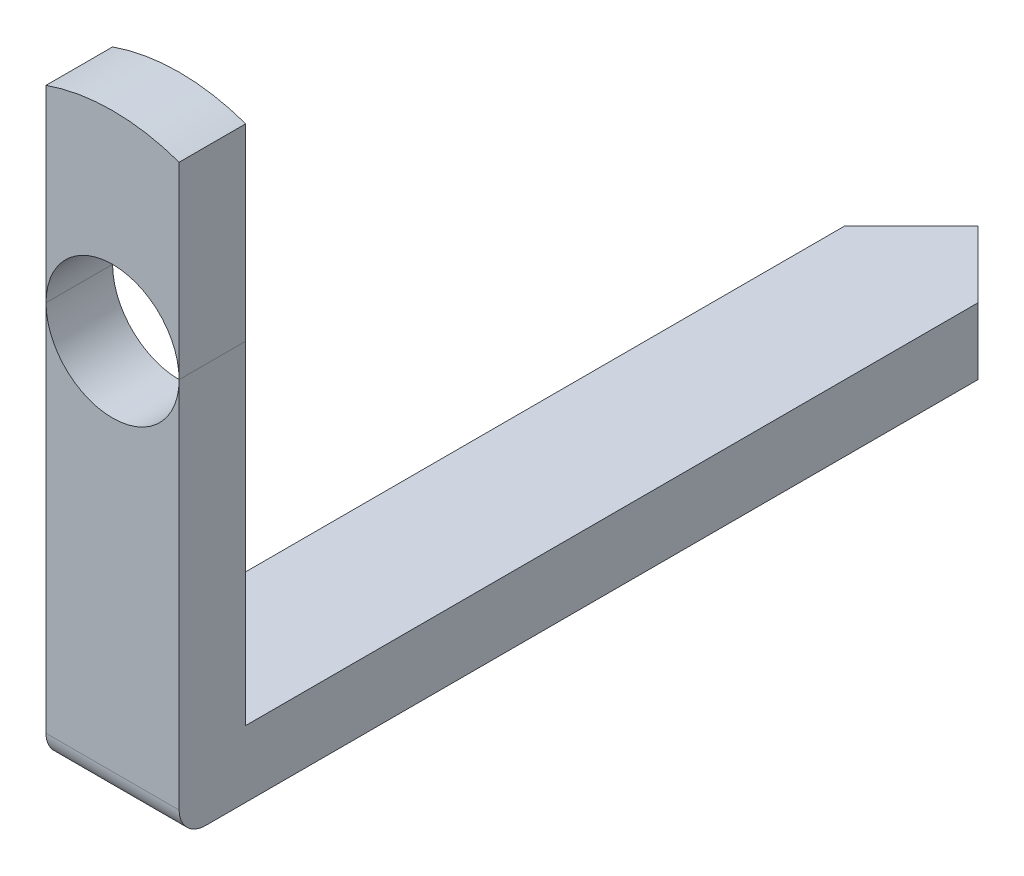
ISO-10303-21;
HEADER;
FILE_DESCRIPTION(('STEP AP214'),'2;1');
FILE_NAME('part.step','',(''),(''),'','','');
FILE_SCHEMA(('AUTOMOTIVE_DESIGN { 1 0 10303 214 1 1 1 1 }'));
ENDSEC;
DATA;
#1=APPLICATION_CONTEXT('core data for automotive mechanical design processes');
#2=APPLICATION_PROTOCOL_DEFINITION('international standard','automotive_design',2000,#1);
#3=PRODUCT_CONTEXT('',#1,'mechanical');
#4=PRODUCT('Part','Part','',(#3));
#5=PRODUCT_RELATED_PRODUCT_CATEGORY('part','',(#4));
#6=PRODUCT_DEFINITION_FORMATION('','',#4);
#7=PRODUCT_DEFINITION_CONTEXT('part definition',#1,'design');
#8=PRODUCT_DEFINITION('design','',#6,#7);
#9=PRODUCT_DEFINITION_SHAPE('','',#8);
#10=(LENGTH_UNIT() NAMED_UNIT(*) SI_UNIT(.MILLI.,.METRE.));
#11=(NAMED_UNIT(*) PLANE_ANGLE_UNIT() SI_UNIT($,.RADIAN.));
#12=(NAMED_UNIT(*) SI_UNIT($,.STERADIAN.) SOLID_ANGLE_UNIT());
#13=UNCERTAINTY_MEASURE_WITH_UNIT(LENGTH_MEASURE(1.E-05),#10,'distance_accuracy_value','');
#14=(GEOMETRIC_REPRESENTATION_CONTEXT(3) GLOBAL_UNCERTAINTY_ASSIGNED_CONTEXT((#13)) GLOBAL_UNIT_ASSIGNED_CONTEXT((#10,
#11,#12)) REPRESENTATION_CONTEXT('',''));
#15=CARTESIAN_POINT('',(0.,0.,0.));
#16=DIRECTION('',(0.,0.,1.));
#17=DIRECTION('',(1.,0.,0.));
#18=AXIS2_PLACEMENT_3D('',#15,#16,#17);
#19=CARTESIAN_POINT('',(0.,0.,0.));
#20=DIRECTION('',(0.,0.,1.));
#21=DIRECTION('',(1.,0.,0.));
#22=AXIS2_PLACEMENT_3D('',#19,#20,#21);
#23=PLANE('',#22);
#24=DIRECTION('',(1.,0.,0.));
#25=VECTOR('',#24,1.);
#26=CARTESIAN_POINT('',(0.,-2.5,0.));
#27=LINE('',#26,#25);
#28=CARTESIAN_POINT('',(-0.5,-2.5,0.));
#29=VERTEX_POINT('',#28);
#30=CARTESIAN_POINT('',(0.5,-2.5,0.));
#31=VERTEX_POINT('',#30);
#32=EDGE_CURVE('E126',#29,#31,#27,.T.);
#33=ORIENTED_EDGE('',*,*,#32,.F.);
#34=DIRECTION('',(0.,1.,0.));
#35=VECTOR('',#34,1.);
#36=CARTESIAN_POINT('',(-0.5,0.,0.));
#37=LINE('',#36,#35);
#38=CARTESIAN_POINT('',(-0.5,0.,0.));
#39=VERTEX_POINT('',#38);
#40=EDGE_CURVE('E144',#29,#39,#37,.T.);
#41=ORIENTED_EDGE('',*,*,#40,.T.);
#42=CARTESIAN_POINT('',(0.,0.,0.));
#43=DIRECTION('',(0.,0.,1.));
#44=DIRECTION('',(1.,0.,0.));
#45=AXIS2_PLACEMENT_3D('',#42,#43,#44);
#46=CIRCLE('',#45,0.5);
#47=CARTESIAN_POINT('',(0.5,0.,0.));
#48=VERTEX_POINT('',#47);
#49=EDGE_CURVE('E141',#39,#48,#46,.T.);
#50=ORIENTED_EDGE('',*,*,#49,.T.);
#51=DIRECTION('',(0.,-1.,0.));
#52=VECTOR('',#51,1.);
#53=CARTESIAN_POINT('',(0.5,0.,0.));
#54=LINE('',#53,#52);
#55=EDGE_CURVE('E81',#48,#31,#54,.T.);
#56=ORIENTED_EDGE('',*,*,#55,.T.);
#57=EDGE_LOOP('',(#33,#41,#50,#56));
#58=FACE_BOUND('',#57,.T.);
#59=ADVANCED_FACE('F42',(#58),#23,.F.);
#60=CARTESIAN_POINT('',(0.,0.,0.5));
#61=DIRECTION('',(0.,0.,1.));
#62=DIRECTION('',(1.,0.,0.));
#63=AXIS2_PLACEMENT_3D('',#60,#61,#62);
#64=PLANE('',#63);
#65=DIRECTION('',(0.,1.,0.));
#66=VECTOR('',#65,1.);
#67=CARTESIAN_POINT('',(-0.5,0.,0.5));
#68=LINE('',#67,#66);
#69=CARTESIAN_POINT('',(-0.5,-2.8,0.5));
#70=VERTEX_POINT('',#69);
#71=CARTESIAN_POINT('',(-0.5,0.,0.5));
#72=VERTEX_POINT('',#71);
#73=EDGE_CURVE('E51',#70,#72,#68,.T.);
#74=ORIENTED_EDGE('',*,*,#73,.F.);
#75=DIRECTION('',(1.,0.,0.));
#76=VECTOR('',#75,1.);
#77=CARTESIAN_POINT('',(1.5,-2.8,0.5));
#78=LINE('',#77,#76);
#79=CARTESIAN_POINT('',(0.5,-2.8,0.5));
#80=VERTEX_POINT('',#79);
#81=EDGE_CURVE('E149',#70,#80,#78,.T.);
#82=ORIENTED_EDGE('',*,*,#81,.T.);
#83=DIRECTION('',(0.,-1.,0.));
#84=VECTOR('',#83,1.);
#85=CARTESIAN_POINT('',(0.5,0.,0.5));
#86=LINE('',#85,#84);
#87=CARTESIAN_POINT('',(0.5,0.,0.5));
#88=VERTEX_POINT('',#87);
#89=EDGE_CURVE('E45',#88,#80,#86,.T.);
#90=ORIENTED_EDGE('',*,*,#89,.F.);
#91=CARTESIAN_POINT('',(0.,0.,0.5));
#92=DIRECTION('',(0.,0.,1.));
#93=DIRECTION('',(1.,0.,0.));
#94=AXIS2_PLACEMENT_3D('',#91,#92,#93);
#95=CIRCLE('',#94,0.5);
#96=EDGE_CURVE('E136',#72,#88,#95,.T.);
#97=ORIENTED_EDGE('',*,*,#96,.F.);
#98=EDGE_LOOP('',(#74,#82,#90,#97));
#99=FACE_BOUND('',#98,.T.);
#100=ADVANCED_FACE('F184',(#99),#64,.T.);
#101=CARTESIAN_POINT('',(0.5,-2.5,-1.));
#102=DIRECTION('',(1.,0.,0.));
#103=DIRECTION('',(0.,0.,-1.));
#104=AXIS2_PLACEMENT_3D('',#101,#102,#103);
#105=PLANE('',#104);
#106=CARTESIAN_POINT('',(0.5,-2.8,0.3));
#107=DIRECTION('',(-1.,0.,0.));
#108=DIRECTION('',(0.,0.,1.));
#109=AXIS2_PLACEMENT_3D('',#106,#107,#108);
#110=CIRCLE('',#109,0.2);
#111=CARTESIAN_POINT('',(0.5,-3.,0.3));
#112=VERTEX_POINT('',#111);
#113=EDGE_CURVE('E177',#80,#112,#110,.F.);
#114=ORIENTED_EDGE('',*,*,#113,.T.);
#115=DIRECTION('',(0.,0.,1.));
#116=VECTOR('',#115,1.);
#117=CARTESIAN_POINT('',(0.5,-3.,-1.));
#118=LINE('',#117,#116);
#119=CARTESIAN_POINT('',(0.500000000000001,-3.,-5.5));
#120=VERTEX_POINT('',#119);
#121=EDGE_CURVE('E140',#120,#112,#118,.T.);
#122=ORIENTED_EDGE('',*,*,#121,.F.);
#123=DIRECTION('',(0.,-1.,0.));
#124=VECTOR('',#123,1.);
#125=CARTESIAN_POINT('',(0.500000000000001,-2.5,-5.5));
#126=LINE('',#125,#124);
#127=CARTESIAN_POINT('',(0.500000000000001,-2.5,-5.5));
#128=VERTEX_POINT('',#127);
#129=EDGE_CURVE('E125',#128,#120,#126,.T.);
#130=ORIENTED_EDGE('',*,*,#129,.F.);
#131=DIRECTION('',(0.,0.,1.));
#132=VECTOR('',#131,1.);
#133=CARTESIAN_POINT('',(0.5,-2.5,-1.));
#134=LINE('',#133,#132);
#135=EDGE_CURVE('E123',#128,#31,#134,.T.);
#136=ORIENTED_EDGE('',*,*,#135,.T.);
#137=ORIENTED_EDGE('',*,*,#55,.F.);
#138=DIRECTION('',(0.,0.,-1.));
#139=VECTOR('',#138,1.);
#140=CARTESIAN_POINT('',(0.5,0.,0.5));
#141=LINE('',#140,#139);
#142=EDGE_CURVE('E139',#88,#48,#141,.T.);
#143=ORIENTED_EDGE('',*,*,#142,.F.);
#144=ORIENTED_EDGE('',*,*,#89,.T.);
#145=EDGE_LOOP('',(#114,#122,#130,#136,#137,#143,#144));
#146=FACE_BOUND('',#145,.T.);
#147=ADVANCED_FACE('F188',(#146),#105,.T.);
#148=CARTESIAN_POINT('',(-0.5,-2.5,-1.));
#149=DIRECTION('',(-1.,0.,0.));
#150=DIRECTION('',(0.,0.,1.));
#151=AXIS2_PLACEMENT_3D('',#148,#149,#150);
#152=PLANE('',#151);
#153=DIRECTION('',(0.,0.,-1.));
#154=VECTOR('',#153,1.);
#155=CARTESIAN_POINT('',(-0.5,-2.5,-1.));
#156=LINE('',#155,#154);
#157=CARTESIAN_POINT('',(-0.499999999999999,-2.5,-5.5));
#158=VERTEX_POINT('',#157);
#159=EDGE_CURVE('E60',#29,#158,#156,.T.);
#160=ORIENTED_EDGE('',*,*,#159,.T.);
#161=DIRECTION('',(0.,-1.,0.));
#162=VECTOR('',#161,1.);
#163=CARTESIAN_POINT('',(-0.499999999999999,-2.5,-5.5));
#164=LINE('',#163,#162);
#165=CARTESIAN_POINT('',(-0.499999999999999,-3.,-5.5));
#166=VERTEX_POINT('',#165);
#167=EDGE_CURVE('E119',#158,#166,#164,.T.);
#168=ORIENTED_EDGE('',*,*,#167,.T.);
#169=DIRECTION('',(0.,0.,-1.));
#170=VECTOR('',#169,1.);
#171=CARTESIAN_POINT('',(-0.5,-3.,-1.));
#172=LINE('',#171,#170);
#173=CARTESIAN_POINT('',(-0.5,-3.,0.3));
#174=VERTEX_POINT('',#173);
#175=EDGE_CURVE('E88',#174,#166,#172,.T.);
#176=ORIENTED_EDGE('',*,*,#175,.F.);
#177=CARTESIAN_POINT('',(-0.5,-2.8,0.3));
#178=DIRECTION('',(1.,0.,0.));
#179=DIRECTION('',(0.,0.,-1.));
#180=AXIS2_PLACEMENT_3D('',#177,#178,#179);
#181=CIRCLE('',#180,0.2);
#182=EDGE_CURVE('E146',#174,#70,#181,.F.);
#183=ORIENTED_EDGE('',*,*,#182,.T.);
#184=ORIENTED_EDGE('',*,*,#73,.T.);
#185=DIRECTION('',(0.,0.,-1.));
#186=VECTOR('',#185,1.);
#187=CARTESIAN_POINT('',(-0.5,0.,0.5));
#188=LINE('',#187,#186);
#189=EDGE_CURVE('E12',#72,#39,#188,.T.);
#190=ORIENTED_EDGE('',*,*,#189,.T.);
#191=ORIENTED_EDGE('',*,*,#40,.F.);
#192=EDGE_LOOP('',(#160,#168,#176,#183,#184,#190,#191));
#193=FACE_BOUND('',#192,.T.);
#194=ADVANCED_FACE('F180',(#193),#152,.T.);
#195=CARTESIAN_POINT('',(1.5,-3.,0.5));
#196=DIRECTION('',(0.,1.,0.));
#197=DIRECTION('',(0.,0.,1.));
#198=AXIS2_PLACEMENT_3D('',#195,#196,#197);
#199=PLANE('',#198);
#200=DIRECTION('',(1.,0.,0.));
#201=VECTOR('',#200,1.);
#202=CARTESIAN_POINT('',(-1.5,-3.,0.3));
#203=LINE('',#202,#201);
#204=EDGE_CURVE('E135',#112,#174,#203,.F.);
#205=ORIENTED_EDGE('',*,*,#204,.T.);
#206=ORIENTED_EDGE('',*,*,#175,.T.);
#207=DIRECTION('',(0.707106781186544,0.,-0.707106781186551));
#208=VECTOR('',#207,1.);
#209=CARTESIAN_POINT('',(-0.499999999999999,-3.,-5.5));
#210=LINE('',#209,#208);
#211=CARTESIAN_POINT('',(0.,-3.,-6.));
#212=VERTEX_POINT('',#211);
#213=EDGE_CURVE('E166',#166,#212,#210,.T.);
#214=ORIENTED_EDGE('',*,*,#213,.T.);
#215=DIRECTION('',(0.707106781186551,0.,0.707106781186544));
#216=VECTOR('',#215,1.);
#217=CARTESIAN_POINT('',(0.,-3.,-6.));
#218=LINE('',#217,#216);
#219=EDGE_CURVE('E114',#212,#120,#218,.T.);
#220=ORIENTED_EDGE('',*,*,#219,.T.);
#221=ORIENTED_EDGE('',*,*,#121,.T.);
#222=EDGE_LOOP('',(#205,#206,#214,#220,#221));
#223=FACE_BOUND('',#222,.T.);
#224=ADVANCED_FACE('F171',(#223),#199,.F.);
#225=CARTESIAN_POINT('',(0.,0.,0.5));
#226=DIRECTION('',(0.,0.,-1.));
#227=DIRECTION('',(-1.,0.,0.));
#228=AXIS2_PLACEMENT_3D('',#225,#226,#227);
#229=CYLINDRICAL_SURFACE('',#228,0.5);
#230=ORIENTED_EDGE('',*,*,#189,.F.);
#231=ORIENTED_EDGE('',*,*,#96,.T.);
#232=ORIENTED_EDGE('',*,*,#142,.T.);
#233=ORIENTED_EDGE('',*,*,#49,.F.);
#234=EDGE_LOOP('',(#230,#231,#232,#233));
#235=FACE_BOUND('',#234,.T.);
#236=ADVANCED_FACE('F194',(#235),#229,.F.);
#237=CARTESIAN_POINT('',(0.,-2.5,0.));
#238=DIRECTION('',(0.,-1.,0.));
#239=DIRECTION('',(0.,0.,-1.));
#240=AXIS2_PLACEMENT_3D('',#237,#238,#239);
#241=PLANE('',#240);
#242=ORIENTED_EDGE('',*,*,#159,.F.);
#243=ORIENTED_EDGE('',*,*,#32,.T.);
#244=ORIENTED_EDGE('',*,*,#135,.F.);
#245=DIRECTION('',(0.707106781186551,0.,0.707106781186544));
#246=VECTOR('',#245,1.);
#247=CARTESIAN_POINT('',(0.,-2.5,-6.));
#248=LINE('',#247,#246);
#249=CARTESIAN_POINT('',(0.,-2.5,-6.));
#250=VERTEX_POINT('',#249);
#251=EDGE_CURVE('E112',#250,#128,#248,.T.);
#252=ORIENTED_EDGE('',*,*,#251,.F.);
#253=DIRECTION('',(0.707106781186544,0.,-0.707106781186551));
#254=VECTOR('',#253,1.);
#255=CARTESIAN_POINT('',(-0.499999999999999,-2.5,-5.5));
#256=LINE('',#255,#254);
#257=EDGE_CURVE('E120',#158,#250,#256,.T.);
#258=ORIENTED_EDGE('',*,*,#257,.F.);
#259=EDGE_LOOP('',(#242,#243,#244,#252,#258));
#260=FACE_BOUND('',#259,.T.);
#261=ADVANCED_FACE('F122',(#260),#241,.F.);
#262=CARTESIAN_POINT('',(0.,-2.5,-6.));
#263=DIRECTION('',(0.707106781186544,0.,-0.707106781186551));
#264=DIRECTION('',(-0.707106781186551,0.,-0.707106781186544));
#265=AXIS2_PLACEMENT_3D('',#262,#263,#264);
#266=PLANE('',#265);
#267=ORIENTED_EDGE('',*,*,#219,.F.);
#268=DIRECTION('',(0.,-1.,0.));
#269=VECTOR('',#268,1.);
#270=CARTESIAN_POINT('',(0.,-2.5,-6.));
#271=LINE('',#270,#269);
#272=EDGE_CURVE('E109',#250,#212,#271,.T.);
#273=ORIENTED_EDGE('',*,*,#272,.F.);
#274=ORIENTED_EDGE('',*,*,#251,.T.);
#275=ORIENTED_EDGE('',*,*,#129,.T.);
#276=EDGE_LOOP('',(#267,#273,#274,#275));
#277=FACE_BOUND('',#276,.T.);
#278=ADVANCED_FACE('F111',(#277),#266,.T.);
#279=CARTESIAN_POINT('',(-0.499999999999999,-2.5,-5.5));
#280=DIRECTION('',(-0.707106781186551,0.,-0.707106781186544));
#281=DIRECTION('',(-0.707106781186544,0.,0.707106781186551));
#282=AXIS2_PLACEMENT_3D('',#279,#280,#281);
#283=PLANE('',#282);
#284=ORIENTED_EDGE('',*,*,#213,.F.);
#285=ORIENTED_EDGE('',*,*,#167,.F.);
#286=ORIENTED_EDGE('',*,*,#257,.T.);
#287=ORIENTED_EDGE('',*,*,#272,.T.);
#288=EDGE_LOOP('',(#284,#285,#286,#287));
#289=FACE_BOUND('',#288,.T.);
#290=ADVANCED_FACE('F129',(#289),#283,.T.);
#291=CARTESIAN_POINT('',(0.,-2.8,0.3));
#292=DIRECTION('',(-1.,0.,0.));
#293=DIRECTION('',(0.,0.,1.));
#294=AXIS2_PLACEMENT_3D('',#291,#292,#293);
#295=CYLINDRICAL_SURFACE('',#294,0.2);
#296=ORIENTED_EDGE('',*,*,#182,.F.);
#297=ORIENTED_EDGE('',*,*,#204,.F.);
#298=ORIENTED_EDGE('',*,*,#113,.F.);
#299=ORIENTED_EDGE('',*,*,#81,.F.);
#300=EDGE_LOOP('',(#296,#297,#298,#299));
#301=FACE_BOUND('',#300,.T.);
#302=ADVANCED_FACE('F176',(#301),#295,.T.);
#303=CLOSED_SHELL('',(#59,#100,#147,#194,#224,#236,#261,#278,#290,#302));
#304=MANIFOLD_SOLID_BREP('B2',#303);
#305=CARTESIAN_POINT('',(0.,0.,0.5));
#306=DIRECTION('',(0.,0.,-1.));
#307=DIRECTION('',(-1.,0.,0.));
#308=AXIS2_PLACEMENT_3D('',#305,#306,#307);
#309=CYLINDRICAL_SURFACE('',#308,1.5);
#310=CARTESIAN_POINT('',(0.,0.,0.));
#311=DIRECTION('',(0.,0.,1.));
#312=DIRECTION('',(1.,0.,0.));
#313=AXIS2_PLACEMENT_3D('',#310,#311,#312);
#314=CIRCLE('',#313,1.5);
#315=CARTESIAN_POINT('',(0.5,1.4142135623731,0.));
#316=VERTEX_POINT('',#315);
#317=CARTESIAN_POINT('',(-0.5,1.4142135623731,0.));
#318=VERTEX_POINT('',#317);
#319=EDGE_CURVE('E281',#316,#318,#314,.T.);
#320=ORIENTED_EDGE('',*,*,#319,.T.);
#321=DIRECTION('',(0.,0.,-1.));
#322=VECTOR('',#321,1.);
#323=CARTESIAN_POINT('',(-0.5,1.4142135623731,0.5));
#324=LINE('',#323,#322);
#325=CARTESIAN_POINT('',(-0.5,1.4142135623731,0.5));
#326=VERTEX_POINT('',#325);
#327=EDGE_CURVE('E334',#318,#326,#324,.F.);
#328=ORIENTED_EDGE('',*,*,#327,.T.);
#329=CARTESIAN_POINT('',(0.,0.,0.5));
#330=DIRECTION('',(0.,0.,1.));
#331=DIRECTION('',(1.,0.,0.));
#332=AXIS2_PLACEMENT_3D('',#329,#330,#331);
#333=CIRCLE('',#332,1.5);
#334=CARTESIAN_POINT('',(0.5,1.4142135623731,0.5));
#335=VERTEX_POINT('',#334);
#336=EDGE_CURVE('E40',#335,#326,#333,.T.);
#337=ORIENTED_EDGE('',*,*,#336,.F.);
#338=DIRECTION('',(0.,0.,-1.));
#339=VECTOR('',#338,1.);
#340=CARTESIAN_POINT('',(0.5,1.4142135623731,0.5));
#341=LINE('',#340,#339);
#342=EDGE_CURVE('E316',#335,#316,#341,.T.);
#343=ORIENTED_EDGE('',*,*,#342,.T.);
#344=EDGE_LOOP('',(#320,#328,#337,#343));
#345=FACE_BOUND('',#344,.T.);
#346=ADVANCED_FACE('F278',(#345),#309,.T.);
#347=CARTESIAN_POINT('',(0.,0.,0.5));
#348=DIRECTION('',(0.,0.,-1.));
#349=DIRECTION('',(-1.,0.,0.));
#350=AXIS2_PLACEMENT_3D('',#347,#348,#349);
#351=CYLINDRICAL_SURFACE('',#350,0.5);
#352=CARTESIAN_POINT('',(0.,0.,0.5));
#353=DIRECTION('',(0.,0.,1.));
#354=DIRECTION('',(1.,0.,0.));
#355=AXIS2_PLACEMENT_3D('',#352,#353,#354);
#356=CIRCLE('',#355,0.5);
#357=CARTESIAN_POINT('',(0.5,0.,0.5));
#358=VERTEX_POINT('',#357);
#359=CARTESIAN_POINT('',(-0.5,0.,0.5));
#360=VERTEX_POINT('',#359);
#361=EDGE_CURVE('E331',#358,#360,#356,.T.);
#362=ORIENTED_EDGE('',*,*,#361,.T.);
#363=DIRECTION('',(0.,0.,-1.));
#364=VECTOR('',#363,1.);
#365=CARTESIAN_POINT('',(-0.5,0.,0.5));
#366=LINE('',#365,#364);
#367=CARTESIAN_POINT('',(-0.5,0.,0.));
#368=VERTEX_POINT('',#367);
#369=EDGE_CURVE('E292',#360,#368,#366,.T.);
#370=ORIENTED_EDGE('',*,*,#369,.T.);
#371=CARTESIAN_POINT('',(0.,0.,0.));
#372=DIRECTION('',(0.,0.,1.));
#373=DIRECTION('',(1.,0.,0.));
#374=AXIS2_PLACEMENT_3D('',#371,#372,#373);
#375=CIRCLE('',#374,0.5);
#376=CARTESIAN_POINT('',(0.5,0.,0.));
#377=VERTEX_POINT('',#376);
#378=EDGE_CURVE('E339',#377,#368,#375,.T.);
#379=ORIENTED_EDGE('',*,*,#378,.F.);
#380=DIRECTION('',(0.,0.,-1.));
#381=VECTOR('',#380,1.);
#382=CARTESIAN_POINT('',(0.5,0.,0.5));
#383=LINE('',#382,#381);
#384=EDGE_CURVE('E300',#358,#377,#383,.T.);
#385=ORIENTED_EDGE('',*,*,#384,.F.);
#386=EDGE_LOOP('',(#362,#370,#379,#385));
#387=FACE_BOUND('',#386,.T.);
#388=ADVANCED_FACE('F349',(#387),#351,.F.);
#389=CARTESIAN_POINT('',(0.,0.,0.5));
#390=DIRECTION('',(0.,0.,1.));
#391=DIRECTION('',(1.,0.,0.));
#392=AXIS2_PLACEMENT_3D('',#389,#390,#391);
#393=PLANE('',#392);
#394=DIRECTION('',(0.,1.,0.));
#395=VECTOR('',#394,1.);
#396=CARTESIAN_POINT('',(-0.5,0.,0.5));
#397=LINE('',#396,#395);
#398=EDGE_CURVE('E336',#360,#326,#397,.T.);
#399=ORIENTED_EDGE('',*,*,#398,.F.);
#400=ORIENTED_EDGE('',*,*,#361,.F.);
#401=DIRECTION('',(0.,-1.,0.));
#402=VECTOR('',#401,1.);
#403=CARTESIAN_POINT('',(0.5,0.,0.5));
#404=LINE('',#403,#402);
#405=EDGE_CURVE('E319',#335,#358,#404,.T.);
#406=ORIENTED_EDGE('',*,*,#405,.F.);
#407=ORIENTED_EDGE('',*,*,#336,.T.);
#408=EDGE_LOOP('',(#399,#400,#406,#407));
#409=FACE_BOUND('',#408,.T.);
#410=ADVANCED_FACE('F330',(#409),#393,.T.);
#411=CARTESIAN_POINT('',(0.,0.,0.));
#412=DIRECTION('',(0.,0.,1.));
#413=DIRECTION('',(1.,0.,0.));
#414=AXIS2_PLACEMENT_3D('',#411,#412,#413);
#415=PLANE('',#414);
#416=ORIENTED_EDGE('',*,*,#378,.T.);
#417=DIRECTION('',(0.,1.,0.));
#418=VECTOR('',#417,1.);
#419=CARTESIAN_POINT('',(-0.5,0.,0.));
#420=LINE('',#419,#418);
#421=EDGE_CURVE('E337',#368,#318,#420,.T.);
#422=ORIENTED_EDGE('',*,*,#421,.T.);
#423=ORIENTED_EDGE('',*,*,#319,.F.);
#424=DIRECTION('',(0.,-1.,0.));
#425=VECTOR('',#424,1.);
#426=CARTESIAN_POINT('',(0.5,0.,0.));
#427=LINE('',#426,#425);
#428=EDGE_CURVE('E321',#316,#377,#427,.T.);
#429=ORIENTED_EDGE('',*,*,#428,.T.);
#430=EDGE_LOOP('',(#416,#422,#423,#429));
#431=FACE_BOUND('',#430,.T.);
#432=ADVANCED_FACE('F347',(#431),#415,.F.);
#433=CARTESIAN_POINT('',(0.5,1.5,-1.24986889575583));
#434=DIRECTION('',(-1.,0.,0.));
#435=DIRECTION('',(0.,0.,1.));
#436=AXIS2_PLACEMENT_3D('',#433,#434,#435);
#437=PLANE('',#436);
#438=ORIENTED_EDGE('',*,*,#384,.T.);
#439=ORIENTED_EDGE('',*,*,#428,.F.);
#440=ORIENTED_EDGE('',*,*,#342,.F.);
#441=ORIENTED_EDGE('',*,*,#405,.T.);
#442=EDGE_LOOP('',(#438,#439,#440,#441));
#443=FACE_BOUND('',#442,.T.);
#444=ADVANCED_FACE('F318',(#443),#437,.F.);
#445=CARTESIAN_POINT('',(-0.5,1.5,-1.24986889575583));
#446=DIRECTION('',(1.,0.,0.));
#447=DIRECTION('',(0.,0.,-1.));
#448=AXIS2_PLACEMENT_3D('',#445,#446,#447);
#449=PLANE('',#448);
#450=ORIENTED_EDGE('',*,*,#398,.T.);
#451=ORIENTED_EDGE('',*,*,#327,.F.);
#452=ORIENTED_EDGE('',*,*,#421,.F.);
#453=ORIENTED_EDGE('',*,*,#369,.F.);
#454=EDGE_LOOP('',(#450,#451,#452,#453));
#455=FACE_BOUND('',#454,.T.);
#456=ADVANCED_FACE('F352',(#455),#449,.F.);
#457=CLOSED_SHELL('',(#346,#388,#410,#432,#444,#456));
#458=MANIFOLD_SOLID_BREP('B6',#457);
#459=ADVANCED_BREP_SHAPE_REPRESENTATION('',(#18,#304,#458),#14);
#460=SHAPE_DEFINITION_REPRESENTATION(#9,#459);
ENDSEC;
END-ISO-10303-21;
